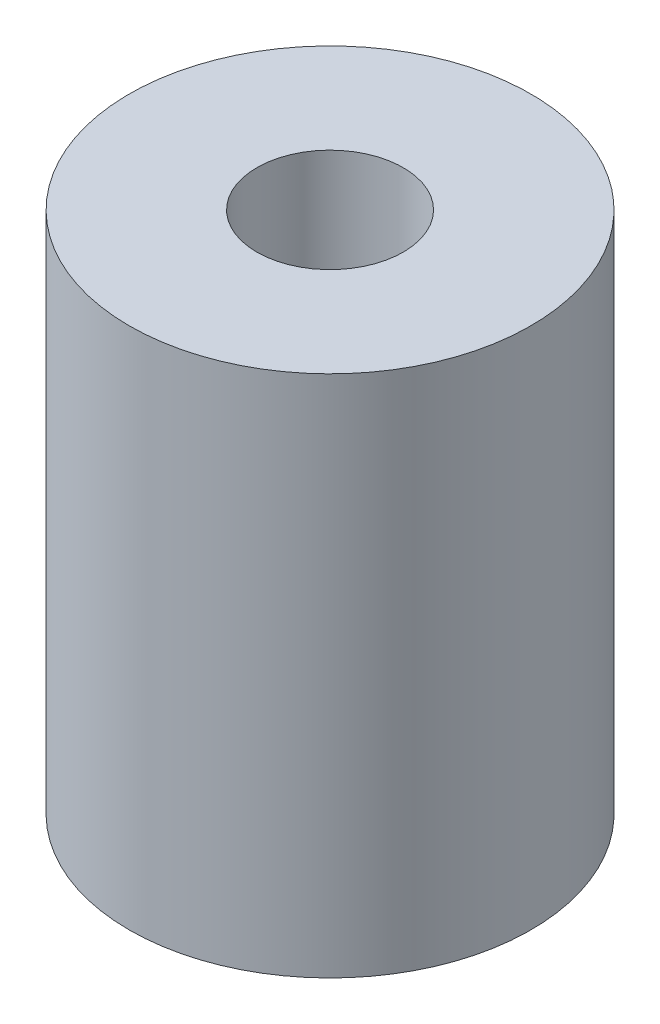
ISO-10303-21;
HEADER;
FILE_DESCRIPTION(('STEP AP214'),'2;1');
FILE_NAME('part.step','',(''),(''),'','','');
FILE_SCHEMA(('AUTOMOTIVE_DESIGN { 1 0 10303 214 1 1 1 1 }'));
ENDSEC;
DATA;
#1=APPLICATION_CONTEXT('core data for automotive mechanical design processes');
#2=APPLICATION_PROTOCOL_DEFINITION('international standard','automotive_design',2000,#1);
#3=PRODUCT_CONTEXT('',#1,'mechanical');
#4=PRODUCT('Part','Part','',(#3));
#5=PRODUCT_RELATED_PRODUCT_CATEGORY('part','',(#4));
#6=PRODUCT_DEFINITION_FORMATION('','',#4);
#7=PRODUCT_DEFINITION_CONTEXT('part definition',#1,'design');
#8=PRODUCT_DEFINITION('design','',#6,#7);
#9=PRODUCT_DEFINITION_SHAPE('','',#8);
#10=(LENGTH_UNIT() NAMED_UNIT(*) SI_UNIT(.MILLI.,.METRE.));
#11=(NAMED_UNIT(*) PLANE_ANGLE_UNIT() SI_UNIT($,.RADIAN.));
#12=(NAMED_UNIT(*) SI_UNIT($,.STERADIAN.) SOLID_ANGLE_UNIT());
#13=UNCERTAINTY_MEASURE_WITH_UNIT(LENGTH_MEASURE(1.E-05),#10,'distance_accuracy_value','');
#14=(GEOMETRIC_REPRESENTATION_CONTEXT(3) GLOBAL_UNCERTAINTY_ASSIGNED_CONTEXT((#13)) GLOBAL_UNIT_ASSIGNED_CONTEXT((#10,
#11,#12)) REPRESENTATION_CONTEXT('',''));
#15=CARTESIAN_POINT('',(0.,0.,0.));
#16=DIRECTION('',(0.,0.,1.));
#17=DIRECTION('',(1.,0.,0.));
#18=AXIS2_PLACEMENT_3D('',#15,#16,#17);
#19=CARTESIAN_POINT('',(0.,28.956,0.));
#20=DIRECTION('',(0.,1.,0.));
#21=DIRECTION('',(0.,0.,1.));
#22=AXIS2_PLACEMENT_3D('',#19,#20,#21);
#23=PLANE('',#22);
#24=CARTESIAN_POINT('',(0.,28.956,0.));
#25=DIRECTION('',(0.,1.,0.));
#26=DIRECTION('',(0.,0.,1.));
#27=AXIS2_PLACEMENT_3D('',#24,#25,#26);
#28=CIRCLE('',#27,11.1125);
#29=CARTESIAN_POINT('',(0.,28.956,11.1125));
#30=VERTEX_POINT('',#29);
#31=EDGE_CURVE('E12',#30,#30,#28,.T.);
#32=ORIENTED_EDGE('',*,*,#31,.T.);
#33=EDGE_LOOP('',(#32));
#34=FACE_BOUND('',#33,.T.);
#35=CARTESIAN_POINT('',(0.,28.956,0.));
#36=DIRECTION('',(0.,1.,0.));
#37=DIRECTION('',(0.,0.,1.));
#38=AXIS2_PLACEMENT_3D('',#35,#36,#37);
#39=CIRCLE('',#38,4.0513);
#40=CARTESIAN_POINT('',(0.,28.956,4.0513));
#41=VERTEX_POINT('',#40);
#42=EDGE_CURVE('E55',#41,#41,#39,.T.);
#43=ORIENTED_EDGE('',*,*,#42,.F.);
#44=EDGE_LOOP('',(#43));
#45=FACE_BOUND('',#44,.T.);
#46=ADVANCED_FACE('F44',(#34,#45),#23,.T.);
#47=CARTESIAN_POINT('',(0.,0.,0.));
#48=DIRECTION('',(0.,1.,0.));
#49=DIRECTION('',(0.,0.,1.));
#50=AXIS2_PLACEMENT_3D('',#47,#48,#49);
#51=PLANE('',#50);
#52=CARTESIAN_POINT('',(0.,0.,0.));
#53=DIRECTION('',(0.,1.,0.));
#54=DIRECTION('',(0.,0.,1.));
#55=AXIS2_PLACEMENT_3D('',#52,#53,#54);
#56=CIRCLE('',#55,11.1125);
#57=CARTESIAN_POINT('',(0.,0.,11.1125));
#58=VERTEX_POINT('',#57);
#59=EDGE_CURVE('E48',#58,#58,#56,.T.);
#60=ORIENTED_EDGE('',*,*,#59,.F.);
#61=EDGE_LOOP('',(#60));
#62=FACE_BOUND('',#61,.T.);
#63=CARTESIAN_POINT('',(0.,0.,0.));
#64=DIRECTION('',(0.,1.,0.));
#65=DIRECTION('',(0.,0.,1.));
#66=AXIS2_PLACEMENT_3D('',#63,#64,#65);
#67=CIRCLE('',#66,4.0513);
#68=CARTESIAN_POINT('',(0.,0.,4.0513));
#69=VERTEX_POINT('',#68);
#70=EDGE_CURVE('E57',#69,#69,#67,.T.);
#71=ORIENTED_EDGE('',*,*,#70,.T.);
#72=EDGE_LOOP('',(#71));
#73=FACE_BOUND('',#72,.T.);
#74=ADVANCED_FACE('F67',(#62,#73),#51,.F.);
#75=CARTESIAN_POINT('',(0.,28.956,0.));
#76=DIRECTION('',(0.,-1.,0.));
#77=DIRECTION('',(0.,0.,-1.));
#78=AXIS2_PLACEMENT_3D('',#75,#76,#77);
#79=CYLINDRICAL_SURFACE('',#78,11.1125);
#80=ORIENTED_EDGE('',*,*,#31,.F.);
#81=EDGE_LOOP('',(#80));
#82=FACE_BOUND('',#81,.T.);
#83=ORIENTED_EDGE('',*,*,#59,.T.);
#84=EDGE_LOOP('',(#83));
#85=FACE_BOUND('',#84,.T.);
#86=ADVANCED_FACE('F46',(#82,#85),#79,.T.);
#87=CARTESIAN_POINT('',(0.,28.956,0.));
#88=DIRECTION('',(0.,-1.,0.));
#89=DIRECTION('',(0.,0.,-1.));
#90=AXIS2_PLACEMENT_3D('',#87,#88,#89);
#91=CYLINDRICAL_SURFACE('',#90,4.0513);
#92=ORIENTED_EDGE('',*,*,#42,.T.);
#93=EDGE_LOOP('',(#92));
#94=FACE_BOUND('',#93,.T.);
#95=ORIENTED_EDGE('',*,*,#70,.F.);
#96=EDGE_LOOP('',(#95));
#97=FACE_BOUND('',#96,.T.);
#98=ADVANCED_FACE('F63',(#94,#97),#91,.F.);
#99=CLOSED_SHELL('',(#46,#74,#86,#98));
#100=MANIFOLD_SOLID_BREP('B2',#99);
#101=ADVANCED_BREP_SHAPE_REPRESENTATION('',(#18,#100),#14);
#102=SHAPE_DEFINITION_REPRESENTATION(#9,#101);
ENDSEC;
END-ISO-10303-21;
